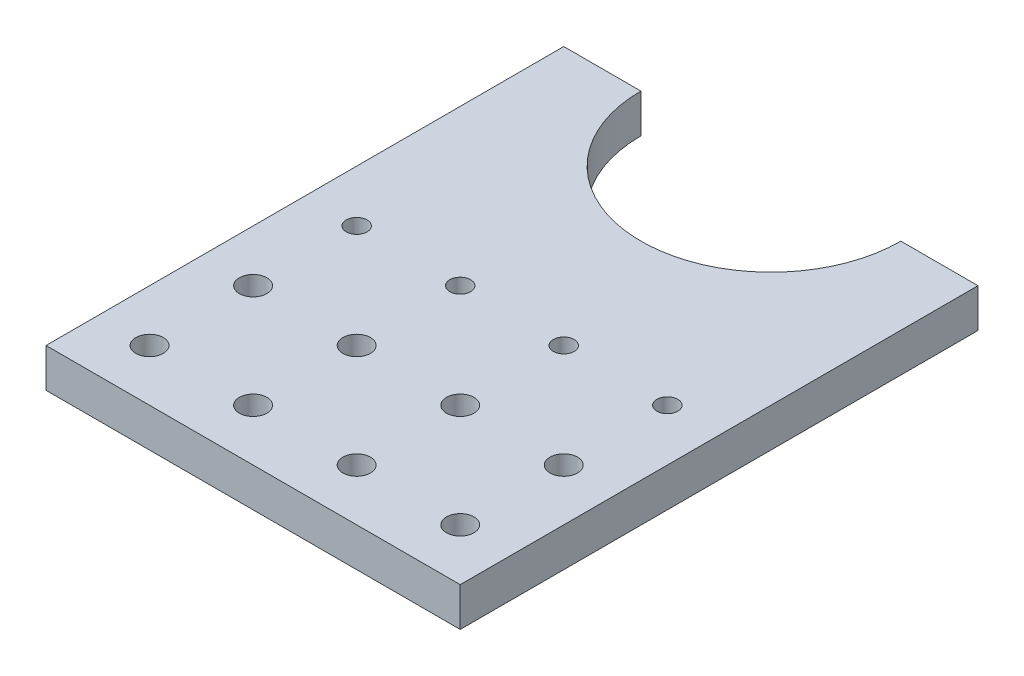
ISO-10303-21;
HEADER;
FILE_DESCRIPTION(('STEP AP214'),'2;1');
FILE_NAME('part.step','',(''),(''),'','','');
FILE_SCHEMA(('AUTOMOTIVE_DESIGN { 1 0 10303 214 1 1 1 1 }'));
ENDSEC;
DATA;
#1=APPLICATION_CONTEXT('core data for automotive mechanical design processes');
#2=APPLICATION_PROTOCOL_DEFINITION('international standard','automotive_design',2000,#1);
#3=PRODUCT_CONTEXT('',#1,'mechanical');
#4=PRODUCT('Part','Part','',(#3));
#5=PRODUCT_RELATED_PRODUCT_CATEGORY('part','',(#4));
#6=PRODUCT_DEFINITION_FORMATION('','',#4);
#7=PRODUCT_DEFINITION_CONTEXT('part definition',#1,'design');
#8=PRODUCT_DEFINITION('design','',#6,#7);
#9=PRODUCT_DEFINITION_SHAPE('','',#8);
#10=(LENGTH_UNIT() NAMED_UNIT(*) SI_UNIT(.MILLI.,.METRE.));
#11=(NAMED_UNIT(*) PLANE_ANGLE_UNIT() SI_UNIT($,.RADIAN.));
#12=(NAMED_UNIT(*) SI_UNIT($,.STERADIAN.) SOLID_ANGLE_UNIT());
#13=UNCERTAINTY_MEASURE_WITH_UNIT(LENGTH_MEASURE(1.E-05),#10,'distance_accuracy_value','');
#14=(GEOMETRIC_REPRESENTATION_CONTEXT(3) GLOBAL_UNCERTAINTY_ASSIGNED_CONTEXT((#13)) GLOBAL_UNIT_ASSIGNED_CONTEXT((#10,
#11,#12)) REPRESENTATION_CONTEXT('',''));
#15=CARTESIAN_POINT('',(0.,0.,0.));
#16=DIRECTION('',(0.,0.,1.));
#17=DIRECTION('',(1.,0.,0.));
#18=AXIS2_PLACEMENT_3D('',#15,#16,#17);
#19=CARTESIAN_POINT('',(0.,9.525,-127.));
#20=DIRECTION('',(0.,-1.,0.));
#21=DIRECTION('',(0.,0.,-1.));
#22=AXIS2_PLACEMENT_3D('',#19,#20,#21);
#23=PLANE('',#22);
#24=CARTESIAN_POINT('',(38.1,9.525,-63.5));
#25=DIRECTION('',(0.,1.,0.));
#26=DIRECTION('',(0.,0.,1.));
#27=AXIS2_PLACEMENT_3D('',#24,#25,#26);
#28=CIRCLE('',#27,2.55269999999999);
#29=CARTESIAN_POINT('',(38.1,9.525,-60.9473));
#30=VERTEX_POINT('',#29);
#31=EDGE_CURVE('E298',#30,#30,#28,.T.);
#32=ORIENTED_EDGE('',*,*,#31,.F.);
#33=EDGE_LOOP('',(#32));
#34=FACE_BOUND('',#33,.T.);
#35=CARTESIAN_POINT('',(88.9,9.525,-38.1));
#36=DIRECTION('',(0.,1.,0.));
#37=DIRECTION('',(0.,0.,1.));
#38=AXIS2_PLACEMENT_3D('',#35,#36,#37);
#39=CIRCLE('',#38,3.37819999999999);
#40=CARTESIAN_POINT('',(88.9,9.525,-34.7218));
#41=VERTEX_POINT('',#40);
#42=EDGE_CURVE('E160',#41,#41,#39,.T.);
#43=ORIENTED_EDGE('',*,*,#42,.F.);
#44=EDGE_LOOP('',(#43));
#45=FACE_BOUND('',#44,.T.);
#46=CARTESIAN_POINT('',(88.9,9.525,-12.7));
#47=DIRECTION('',(0.,1.,0.));
#48=DIRECTION('',(0.,0.,1.));
#49=AXIS2_PLACEMENT_3D('',#46,#47,#48);
#50=CIRCLE('',#49,3.37819999999999);
#51=CARTESIAN_POINT('',(88.9,9.525,-9.32180000000001));
#52=VERTEX_POINT('',#51);
#53=EDGE_CURVE('E154',#52,#52,#50,.T.);
#54=ORIENTED_EDGE('',*,*,#53,.F.);
#55=EDGE_LOOP('',(#54));
#56=FACE_BOUND('',#55,.T.);
#57=CARTESIAN_POINT('',(63.5,9.525,-38.1));
#58=DIRECTION('',(0.,1.,0.));
#59=DIRECTION('',(0.,0.,1.));
#60=AXIS2_PLACEMENT_3D('',#57,#58,#59);
#61=CIRCLE('',#60,3.37819999999999);
#62=CARTESIAN_POINT('',(63.5,9.525,-34.7218));
#63=VERTEX_POINT('',#62);
#64=EDGE_CURVE('E148',#63,#63,#61,.T.);
#65=ORIENTED_EDGE('',*,*,#64,.F.);
#66=EDGE_LOOP('',(#65));
#67=FACE_BOUND('',#66,.T.);
#68=CARTESIAN_POINT('',(63.5,9.525,-12.7));
#69=DIRECTION('',(0.,1.,0.));
#70=DIRECTION('',(0.,0.,1.));
#71=AXIS2_PLACEMENT_3D('',#68,#69,#70);
#72=CIRCLE('',#71,3.37819999999999);
#73=CARTESIAN_POINT('',(63.5,9.525,-9.32180000000001));
#74=VERTEX_POINT('',#73);
#75=EDGE_CURVE('E142',#74,#74,#72,.T.);
#76=ORIENTED_EDGE('',*,*,#75,.F.);
#77=EDGE_LOOP('',(#76));
#78=FACE_BOUND('',#77,.T.);
#79=CARTESIAN_POINT('',(38.1,9.525,-38.1));
#80=DIRECTION('',(0.,1.,0.));
#81=DIRECTION('',(0.,0.,1.));
#82=AXIS2_PLACEMENT_3D('',#79,#80,#81);
#83=CIRCLE('',#82,3.37819999999999);
#84=CARTESIAN_POINT('',(38.1,9.525,-34.7218));
#85=VERTEX_POINT('',#84);
#86=EDGE_CURVE('E136',#85,#85,#83,.T.);
#87=ORIENTED_EDGE('',*,*,#86,.F.);
#88=EDGE_LOOP('',(#87));
#89=FACE_BOUND('',#88,.T.);
#90=CARTESIAN_POINT('',(38.1,9.525,-12.7));
#91=DIRECTION('',(0.,1.,0.));
#92=DIRECTION('',(0.,0.,1.));
#93=AXIS2_PLACEMENT_3D('',#90,#91,#92);
#94=CIRCLE('',#93,3.37819999999999);
#95=CARTESIAN_POINT('',(38.1,9.525,-9.32180000000001));
#96=VERTEX_POINT('',#95);
#97=EDGE_CURVE('E130',#96,#96,#94,.T.);
#98=ORIENTED_EDGE('',*,*,#97,.F.);
#99=EDGE_LOOP('',(#98));
#100=FACE_BOUND('',#99,.T.);
#101=DIRECTION('',(-1.,0.,0.));
#102=VECTOR('',#101,1.);
#103=CARTESIAN_POINT('',(0.,9.525,-127.));
#104=LINE('',#103,#102);
#105=CARTESIAN_POINT('',(101.6,9.525,-127.));
#106=VERTEX_POINT('',#105);
#107=CARTESIAN_POINT('',(82.677,9.525,-127.));
#108=VERTEX_POINT('',#107);
#109=EDGE_CURVE('E121',#106,#108,#104,.T.);
#110=ORIENTED_EDGE('',*,*,#109,.T.);
#111=CARTESIAN_POINT('',(50.8,9.525,-127.));
#112=DIRECTION('',(0.,1.,0.));
#113=DIRECTION('',(0.,0.,1.));
#114=AXIS2_PLACEMENT_3D('',#111,#112,#113);
#115=CIRCLE('',#114,31.877);
#116=CARTESIAN_POINT('',(18.923,9.525,-127.));
#117=VERTEX_POINT('',#116);
#118=EDGE_CURVE('E103',#117,#108,#115,.T.);
#119=ORIENTED_EDGE('',*,*,#118,.F.);
#120=CARTESIAN_POINT('',(0.,9.525,-127.));
#121=VERTEX_POINT('',#120);
#122=EDGE_CURVE('E56',#117,#121,#104,.T.);
#123=ORIENTED_EDGE('',*,*,#122,.T.);
#124=DIRECTION('',(0.,0.,1.));
#125=VECTOR('',#124,1.);
#126=CARTESIAN_POINT('',(0.,9.525,0.));
#127=LINE('',#126,#125);
#128=CARTESIAN_POINT('',(0.,9.525,0.));
#129=VERTEX_POINT('',#128);
#130=EDGE_CURVE('E113',#121,#129,#127,.T.);
#131=ORIENTED_EDGE('',*,*,#130,.T.);
#132=DIRECTION('',(1.,0.,0.));
#133=VECTOR('',#132,1.);
#134=CARTESIAN_POINT('',(0.,9.525,0.));
#135=LINE('',#134,#133);
#136=CARTESIAN_POINT('',(101.6,9.525,0.));
#137=VERTEX_POINT('',#136);
#138=EDGE_CURVE('E86',#129,#137,#135,.T.);
#139=ORIENTED_EDGE('',*,*,#138,.T.);
#140=DIRECTION('',(0.,0.,-1.));
#141=VECTOR('',#140,1.);
#142=CARTESIAN_POINT('',(101.6,9.525,0.));
#143=LINE('',#142,#141);
#144=EDGE_CURVE('E280',#137,#106,#143,.T.);
#145=ORIENTED_EDGE('',*,*,#144,.T.);
#146=EDGE_LOOP('',(#110,#119,#123,#131,#139,#145));
#147=FACE_BOUND('',#146,.T.);
#148=CARTESIAN_POINT('',(12.7,9.525,-12.7));
#149=DIRECTION('',(0.,1.,0.));
#150=DIRECTION('',(0.,0.,1.));
#151=AXIS2_PLACEMENT_3D('',#148,#149,#150);
#152=CIRCLE('',#151,3.37819999999999);
#153=CARTESIAN_POINT('',(12.7,9.525,-9.32180000000001));
#154=VERTEX_POINT('',#153);
#155=EDGE_CURVE('E266',#154,#154,#152,.T.);
#156=ORIENTED_EDGE('',*,*,#155,.F.);
#157=EDGE_LOOP('',(#156));
#158=FACE_BOUND('',#157,.T.);
#159=CARTESIAN_POINT('',(12.7,9.525,-38.1));
#160=DIRECTION('',(0.,1.,0.));
#161=DIRECTION('',(0.,0.,1.));
#162=AXIS2_PLACEMENT_3D('',#159,#160,#161);
#163=CIRCLE('',#162,3.37819999999999);
#164=CARTESIAN_POINT('',(12.7,9.525,-34.7218));
#165=VERTEX_POINT('',#164);
#166=EDGE_CURVE('E268',#165,#165,#163,.T.);
#167=ORIENTED_EDGE('',*,*,#166,.F.);
#168=EDGE_LOOP('',(#167));
#169=FACE_BOUND('',#168,.T.);
#170=CARTESIAN_POINT('',(12.7,9.525,-63.5));
#171=DIRECTION('',(0.,1.,0.));
#172=DIRECTION('',(0.,0.,1.));
#173=AXIS2_PLACEMENT_3D('',#170,#171,#172);
#174=CIRCLE('',#173,2.55269999999999);
#175=CARTESIAN_POINT('',(12.7,9.525,-60.9473));
#176=VERTEX_POINT('',#175);
#177=EDGE_CURVE('E295',#176,#176,#174,.T.);
#178=ORIENTED_EDGE('',*,*,#177,.F.);
#179=EDGE_LOOP('',(#178));
#180=FACE_BOUND('',#179,.T.);
#181=CARTESIAN_POINT('',(63.5,9.525,-63.5));
#182=DIRECTION('',(0.,1.,0.));
#183=DIRECTION('',(0.,0.,1.));
#184=AXIS2_PLACEMENT_3D('',#181,#182,#183);
#185=CIRCLE('',#184,2.55269999999999);
#186=CARTESIAN_POINT('',(63.5,9.525,-60.9473));
#187=VERTEX_POINT('',#186);
#188=EDGE_CURVE('E166',#187,#187,#185,.T.);
#189=ORIENTED_EDGE('',*,*,#188,.F.);
#190=EDGE_LOOP('',(#189));
#191=FACE_BOUND('',#190,.T.);
#192=CARTESIAN_POINT('',(88.9,9.525,-63.5));
#193=DIRECTION('',(0.,1.,0.));
#194=DIRECTION('',(0.,0.,1.));
#195=AXIS2_PLACEMENT_3D('',#192,#193,#194);
#196=CIRCLE('',#195,2.55269999999999);
#197=CARTESIAN_POINT('',(88.9,9.525,-60.9473));
#198=VERTEX_POINT('',#197);
#199=EDGE_CURVE('E11',#198,#198,#196,.T.);
#200=ORIENTED_EDGE('',*,*,#199,.F.);
#201=EDGE_LOOP('',(#200));
#202=FACE_BOUND('',#201,.T.);
#203=ADVANCED_FACE('F32',(#34,#45,#56,#67,#78,#89,#100,#147,#158,#169,#180,#191,#202),#23,.F.);
#204=CARTESIAN_POINT('',(0.,9.525,-127.));
#205=DIRECTION('',(0.,0.,1.));
#206=DIRECTION('',(1.,0.,0.));
#207=AXIS2_PLACEMENT_3D('',#204,#205,#206);
#208=PLANE('',#207);
#209=DIRECTION('',(-1.,0.,0.));
#210=VECTOR('',#209,1.);
#211=CARTESIAN_POINT('',(0.,0.,-127.));
#212=LINE('',#211,#210);
#213=CARTESIAN_POINT('',(101.6,0.,-127.));
#214=VERTEX_POINT('',#213);
#215=CARTESIAN_POINT('',(82.677,0.,-127.));
#216=VERTEX_POINT('',#215);
#217=EDGE_CURVE('E110',#214,#216,#212,.T.);
#218=ORIENTED_EDGE('',*,*,#217,.T.);
#219=DIRECTION('',(0.,1.,0.));
#220=VECTOR('',#219,1.);
#221=CARTESIAN_POINT('',(82.677,0.,-127.));
#222=LINE('',#221,#220);
#223=EDGE_CURVE('E47',#216,#108,#222,.T.);
#224=ORIENTED_EDGE('',*,*,#223,.T.);
#225=ORIENTED_EDGE('',*,*,#109,.F.);
#226=DIRECTION('',(0.,-1.,0.));
#227=VECTOR('',#226,1.);
#228=CARTESIAN_POINT('',(101.6,9.525,-127.));
#229=LINE('',#228,#227);
#230=EDGE_CURVE('E120',#106,#214,#229,.T.);
#231=ORIENTED_EDGE('',*,*,#230,.T.);
#232=EDGE_LOOP('',(#218,#224,#225,#231));
#233=FACE_BOUND('',#232,.T.);
#234=ADVANCED_FACE('F178',(#233),#208,.F.);
#235=CARTESIAN_POINT('',(0.,9.525,0.));
#236=DIRECTION('',(1.,0.,0.));
#237=DIRECTION('',(0.,0.,-1.));
#238=AXIS2_PLACEMENT_3D('',#235,#236,#237);
#239=PLANE('',#238);
#240=DIRECTION('',(0.,0.,1.));
#241=VECTOR('',#240,1.);
#242=CARTESIAN_POINT('',(0.,0.,0.));
#243=LINE('',#242,#241);
#244=CARTESIAN_POINT('',(0.,0.,-127.));
#245=VERTEX_POINT('',#244);
#246=CARTESIAN_POINT('',(0.,0.,0.));
#247=VERTEX_POINT('',#246);
#248=EDGE_CURVE('E109',#245,#247,#243,.T.);
#249=ORIENTED_EDGE('',*,*,#248,.T.);
#250=DIRECTION('',(0.,-1.,0.));
#251=VECTOR('',#250,1.);
#252=CARTESIAN_POINT('',(0.,9.525,0.));
#253=LINE('',#252,#251);
#254=EDGE_CURVE('E100',#129,#247,#253,.T.);
#255=ORIENTED_EDGE('',*,*,#254,.F.);
#256=ORIENTED_EDGE('',*,*,#130,.F.);
#257=DIRECTION('',(0.,-1.,0.));
#258=VECTOR('',#257,1.);
#259=CARTESIAN_POINT('',(0.,9.525,-127.));
#260=LINE('',#259,#258);
#261=EDGE_CURVE('E118',#121,#245,#260,.T.);
#262=ORIENTED_EDGE('',*,*,#261,.T.);
#263=EDGE_LOOP('',(#249,#255,#256,#262));
#264=FACE_BOUND('',#263,.T.);
#265=ADVANCED_FACE('F184',(#264),#239,.F.);
#266=CARTESIAN_POINT('',(0.,9.525,0.));
#267=DIRECTION('',(0.,0.,-1.));
#268=DIRECTION('',(-1.,0.,0.));
#269=AXIS2_PLACEMENT_3D('',#266,#267,#268);
#270=PLANE('',#269);
#271=DIRECTION('',(1.,0.,0.));
#272=VECTOR('',#271,1.);
#273=CARTESIAN_POINT('',(0.,0.,0.));
#274=LINE('',#273,#272);
#275=CARTESIAN_POINT('',(101.6,0.,0.));
#276=VERTEX_POINT('',#275);
#277=EDGE_CURVE('E114',#247,#276,#274,.T.);
#278=ORIENTED_EDGE('',*,*,#277,.T.);
#279=DIRECTION('',(0.,-1.,0.));
#280=VECTOR('',#279,1.);
#281=CARTESIAN_POINT('',(101.6,9.525,0.));
#282=LINE('',#281,#280);
#283=EDGE_CURVE('E124',#137,#276,#282,.T.);
#284=ORIENTED_EDGE('',*,*,#283,.F.);
#285=ORIENTED_EDGE('',*,*,#138,.F.);
#286=ORIENTED_EDGE('',*,*,#254,.T.);
#287=EDGE_LOOP('',(#278,#284,#285,#286));
#288=FACE_BOUND('',#287,.T.);
#289=ADVANCED_FACE('F199',(#288),#270,.F.);
#290=CARTESIAN_POINT('',(101.6,9.525,0.));
#291=DIRECTION('',(-1.,0.,0.));
#292=DIRECTION('',(0.,0.,1.));
#293=AXIS2_PLACEMENT_3D('',#290,#291,#292);
#294=PLANE('',#293);
#295=DIRECTION('',(0.,0.,-1.));
#296=VECTOR('',#295,1.);
#297=CARTESIAN_POINT('',(101.6,0.,0.));
#298=LINE('',#297,#296);
#299=EDGE_CURVE('E111',#276,#214,#298,.T.);
#300=ORIENTED_EDGE('',*,*,#299,.T.);
#301=ORIENTED_EDGE('',*,*,#230,.F.);
#302=ORIENTED_EDGE('',*,*,#144,.F.);
#303=ORIENTED_EDGE('',*,*,#283,.T.);
#304=EDGE_LOOP('',(#300,#301,#302,#303));
#305=FACE_BOUND('',#304,.T.);
#306=ADVANCED_FACE('F196',(#305),#294,.F.);
#307=ORIENTED_EDGE('',*,*,#122,.F.);
#308=DIRECTION('',(0.,1.,0.));
#309=VECTOR('',#308,1.);
#310=CARTESIAN_POINT('',(18.923,0.,-127.));
#311=LINE('',#310,#309);
#312=CARTESIAN_POINT('',(18.923,0.,-127.));
#313=VERTEX_POINT('',#312);
#314=EDGE_CURVE('E95',#117,#313,#311,.F.);
#315=ORIENTED_EDGE('',*,*,#314,.T.);
#316=EDGE_CURVE('E78',#313,#245,#212,.T.);
#317=ORIENTED_EDGE('',*,*,#316,.T.);
#318=ORIENTED_EDGE('',*,*,#261,.F.);
#319=EDGE_LOOP('',(#307,#315,#317,#318));
#320=FACE_BOUND('',#319,.T.);
#321=ADVANCED_FACE('F102',(#320),#208,.F.);
#322=CARTESIAN_POINT('',(0.,0.,-127.));
#323=DIRECTION('',(0.,-1.,0.));
#324=DIRECTION('',(0.,0.,-1.));
#325=AXIS2_PLACEMENT_3D('',#322,#323,#324);
#326=PLANE('',#325);
#327=CARTESIAN_POINT('',(38.1,0.,-63.5));
#328=DIRECTION('',(0.,1.,0.));
#329=DIRECTION('',(0.,0.,1.));
#330=AXIS2_PLACEMENT_3D('',#327,#328,#329);
#331=CIRCLE('',#330,2.5527);
#332=CARTESIAN_POINT('',(38.1,0.,-60.9473));
#333=VERTEX_POINT('',#332);
#334=EDGE_CURVE('E303',#333,#333,#331,.T.);
#335=ORIENTED_EDGE('',*,*,#334,.T.);
#336=EDGE_LOOP('',(#335));
#337=FACE_BOUND('',#336,.T.);
#338=CARTESIAN_POINT('',(12.7,0.,-63.5));
#339=DIRECTION('',(0.,1.,0.));
#340=DIRECTION('',(0.,0.,1.));
#341=AXIS2_PLACEMENT_3D('',#338,#339,#340);
#342=CIRCLE('',#341,2.5527);
#343=CARTESIAN_POINT('',(12.7,0.,-60.9473));
#344=VERTEX_POINT('',#343);
#345=EDGE_CURVE('E297',#344,#344,#342,.T.);
#346=ORIENTED_EDGE('',*,*,#345,.T.);
#347=EDGE_LOOP('',(#346));
#348=FACE_BOUND('',#347,.T.);
#349=CARTESIAN_POINT('',(12.7,0.,-38.1));
#350=DIRECTION('',(0.,1.,0.));
#351=DIRECTION('',(0.,0.,1.));
#352=AXIS2_PLACEMENT_3D('',#349,#350,#351);
#353=CIRCLE('',#352,3.3782);
#354=CARTESIAN_POINT('',(12.7,0.,-34.7218));
#355=VERTEX_POINT('',#354);
#356=EDGE_CURVE('E272',#355,#355,#353,.T.);
#357=ORIENTED_EDGE('',*,*,#356,.T.);
#358=EDGE_LOOP('',(#357));
#359=FACE_BOUND('',#358,.T.);
#360=CARTESIAN_POINT('',(12.7,0.,-12.7));
#361=DIRECTION('',(0.,1.,0.));
#362=DIRECTION('',(0.,0.,1.));
#363=AXIS2_PLACEMENT_3D('',#360,#361,#362);
#364=CIRCLE('',#363,3.3782);
#365=CARTESIAN_POINT('',(12.7,0.,-9.3218));
#366=VERTEX_POINT('',#365);
#367=EDGE_CURVE('E263',#366,#366,#364,.T.);
#368=ORIENTED_EDGE('',*,*,#367,.T.);
#369=EDGE_LOOP('',(#368));
#370=FACE_BOUND('',#369,.T.);
#371=CARTESIAN_POINT('',(50.8,0.,-127.));
#372=DIRECTION('',(0.,-1.,0.));
#373=DIRECTION('',(0.,0.,-1.));
#374=AXIS2_PLACEMENT_3D('',#371,#372,#373);
#375=CIRCLE('',#374,31.877);
#376=EDGE_CURVE('E93',#216,#313,#375,.T.);
#377=ORIENTED_EDGE('',*,*,#376,.F.);
#378=ORIENTED_EDGE('',*,*,#217,.F.);
#379=ORIENTED_EDGE('',*,*,#299,.F.);
#380=ORIENTED_EDGE('',*,*,#277,.F.);
#381=ORIENTED_EDGE('',*,*,#248,.F.);
#382=ORIENTED_EDGE('',*,*,#316,.F.);
#383=EDGE_LOOP('',(#377,#378,#379,#380,#381,#382));
#384=FACE_BOUND('',#383,.T.);
#385=CARTESIAN_POINT('',(38.1,0.,-12.7));
#386=DIRECTION('',(0.,1.,0.));
#387=DIRECTION('',(0.,0.,1.));
#388=AXIS2_PLACEMENT_3D('',#385,#386,#387);
#389=CIRCLE('',#388,3.3782);
#390=CARTESIAN_POINT('',(38.1,0.,-9.3218));
#391=VERTEX_POINT('',#390);
#392=EDGE_CURVE('E99',#391,#391,#389,.T.);
#393=ORIENTED_EDGE('',*,*,#392,.T.);
#394=EDGE_LOOP('',(#393));
#395=FACE_BOUND('',#394,.T.);
#396=CARTESIAN_POINT('',(38.1,0.,-38.1));
#397=DIRECTION('',(0.,1.,0.));
#398=DIRECTION('',(0.,0.,1.));
#399=AXIS2_PLACEMENT_3D('',#396,#397,#398);
#400=CIRCLE('',#399,3.3782);
#401=CARTESIAN_POINT('',(38.1,0.,-34.7218));
#402=VERTEX_POINT('',#401);
#403=EDGE_CURVE('E133',#402,#402,#400,.T.);
#404=ORIENTED_EDGE('',*,*,#403,.T.);
#405=EDGE_LOOP('',(#404));
#406=FACE_BOUND('',#405,.T.);
#407=CARTESIAN_POINT('',(63.5,0.,-12.7));
#408=DIRECTION('',(0.,1.,0.));
#409=DIRECTION('',(0.,0.,1.));
#410=AXIS2_PLACEMENT_3D('',#407,#408,#409);
#411=CIRCLE('',#410,3.3782);
#412=CARTESIAN_POINT('',(63.5,0.,-9.3218));
#413=VERTEX_POINT('',#412);
#414=EDGE_CURVE('E139',#413,#413,#411,.T.);
#415=ORIENTED_EDGE('',*,*,#414,.T.);
#416=EDGE_LOOP('',(#415));
#417=FACE_BOUND('',#416,.T.);
#418=CARTESIAN_POINT('',(63.5,0.,-38.1));
#419=DIRECTION('',(0.,1.,0.));
#420=DIRECTION('',(0.,0.,1.));
#421=AXIS2_PLACEMENT_3D('',#418,#419,#420);
#422=CIRCLE('',#421,3.3782);
#423=CARTESIAN_POINT('',(63.5,0.,-34.7218));
#424=VERTEX_POINT('',#423);
#425=EDGE_CURVE('E145',#424,#424,#422,.T.);
#426=ORIENTED_EDGE('',*,*,#425,.T.);
#427=EDGE_LOOP('',(#426));
#428=FACE_BOUND('',#427,.T.);
#429=CARTESIAN_POINT('',(88.9,0.,-12.7));
#430=DIRECTION('',(0.,1.,0.));
#431=DIRECTION('',(0.,0.,1.));
#432=AXIS2_PLACEMENT_3D('',#429,#430,#431);
#433=CIRCLE('',#432,3.3782);
#434=CARTESIAN_POINT('',(88.9,0.,-9.3218));
#435=VERTEX_POINT('',#434);
#436=EDGE_CURVE('E151',#435,#435,#433,.T.);
#437=ORIENTED_EDGE('',*,*,#436,.T.);
#438=EDGE_LOOP('',(#437));
#439=FACE_BOUND('',#438,.T.);
#440=CARTESIAN_POINT('',(88.9,0.,-38.1));
#441=DIRECTION('',(0.,1.,0.));
#442=DIRECTION('',(0.,0.,1.));
#443=AXIS2_PLACEMENT_3D('',#440,#441,#442);
#444=CIRCLE('',#443,3.3782);
#445=CARTESIAN_POINT('',(88.9,0.,-34.7218));
#446=VERTEX_POINT('',#445);
#447=EDGE_CURVE('E157',#446,#446,#444,.T.);
#448=ORIENTED_EDGE('',*,*,#447,.T.);
#449=EDGE_LOOP('',(#448));
#450=FACE_BOUND('',#449,.T.);
#451=CARTESIAN_POINT('',(63.5,0.,-63.5));
#452=DIRECTION('',(0.,1.,0.));
#453=DIRECTION('',(0.,0.,1.));
#454=AXIS2_PLACEMENT_3D('',#451,#452,#453);
#455=CIRCLE('',#454,2.5527);
#456=CARTESIAN_POINT('',(63.5,0.,-60.9473));
#457=VERTEX_POINT('',#456);
#458=EDGE_CURVE('E163',#457,#457,#455,.T.);
#459=ORIENTED_EDGE('',*,*,#458,.T.);
#460=EDGE_LOOP('',(#459));
#461=FACE_BOUND('',#460,.T.);
#462=CARTESIAN_POINT('',(88.9,0.,-63.5));
#463=DIRECTION('',(0.,1.,0.));
#464=DIRECTION('',(0.,0.,1.));
#465=AXIS2_PLACEMENT_3D('',#462,#463,#464);
#466=CIRCLE('',#465,2.5527);
#467=CARTESIAN_POINT('',(88.9,0.,-60.9473));
#468=VERTEX_POINT('',#467);
#469=EDGE_CURVE('E40',#468,#468,#466,.T.);
#470=ORIENTED_EDGE('',*,*,#469,.T.);
#471=EDGE_LOOP('',(#470));
#472=FACE_BOUND('',#471,.T.);
#473=ADVANCED_FACE('F106',(#337,#348,#359,#370,#384,#395,#406,#417,#428,#439,#450,#461,#472),
#326,.T.);
#474=CARTESIAN_POINT('',(50.8,0.,-127.));
#475=DIRECTION('',(0.,1.,0.));
#476=DIRECTION('',(0.,0.,1.));
#477=AXIS2_PLACEMENT_3D('',#474,#475,#476);
#478=CYLINDRICAL_SURFACE('',#477,31.877);
#479=ORIENTED_EDGE('',*,*,#376,.T.);
#480=ORIENTED_EDGE('',*,*,#314,.F.);
#481=ORIENTED_EDGE('',*,*,#118,.T.);
#482=ORIENTED_EDGE('',*,*,#223,.F.);
#483=EDGE_LOOP('',(#479,#480,#481,#482));
#484=FACE_BOUND('',#483,.T.);
#485=ADVANCED_FACE('F94',(#484),#478,.F.);
#486=CARTESIAN_POINT('',(12.7,9.525,-12.7));
#487=DIRECTION('',(0.,1.,0.));
#488=DIRECTION('',(0.,0.,1.));
#489=AXIS2_PLACEMENT_3D('',#486,#487,#488);
#490=CYLINDRICAL_SURFACE('',#489,3.37819999999999);
#491=ORIENTED_EDGE('',*,*,#367,.F.);
#492=EDGE_LOOP('',(#491));
#493=FACE_BOUND('',#492,.T.);
#494=ORIENTED_EDGE('',*,*,#155,.T.);
#495=EDGE_LOOP('',(#494));
#496=FACE_BOUND('',#495,.T.);
#497=ADVANCED_FACE('F253',(#493,#496),#490,.F.);
#498=CARTESIAN_POINT('',(12.7,9.525,-38.1));
#499=DIRECTION('',(0.,1.,0.));
#500=DIRECTION('',(0.,0.,1.));
#501=AXIS2_PLACEMENT_3D('',#498,#499,#500);
#502=CYLINDRICAL_SURFACE('',#501,3.37819999999999);
#503=ORIENTED_EDGE('',*,*,#356,.F.);
#504=EDGE_LOOP('',(#503));
#505=FACE_BOUND('',#504,.T.);
#506=ORIENTED_EDGE('',*,*,#166,.T.);
#507=EDGE_LOOP('',(#506));
#508=FACE_BOUND('',#507,.T.);
#509=ADVANCED_FACE('F210',(#505,#508),#502,.F.);
#510=CARTESIAN_POINT('',(38.1,9.525,-12.7));
#511=DIRECTION('',(0.,1.,0.));
#512=DIRECTION('',(0.,0.,1.));
#513=AXIS2_PLACEMENT_3D('',#510,#511,#512);
#514=CYLINDRICAL_SURFACE('',#513,3.37819999999999);
#515=ORIENTED_EDGE('',*,*,#392,.F.);
#516=EDGE_LOOP('',(#515));
#517=FACE_BOUND('',#516,.T.);
#518=ORIENTED_EDGE('',*,*,#97,.T.);
#519=EDGE_LOOP('',(#518));
#520=FACE_BOUND('',#519,.T.);
#521=ADVANCED_FACE('F206',(#517,#520),#514,.F.);
#522=CARTESIAN_POINT('',(38.1,9.525,-38.1));
#523=DIRECTION('',(0.,1.,0.));
#524=DIRECTION('',(0.,0.,1.));
#525=AXIS2_PLACEMENT_3D('',#522,#523,#524);
#526=CYLINDRICAL_SURFACE('',#525,3.37819999999999);
#527=ORIENTED_EDGE('',*,*,#403,.F.);
#528=EDGE_LOOP('',(#527));
#529=FACE_BOUND('',#528,.T.);
#530=ORIENTED_EDGE('',*,*,#86,.T.);
#531=EDGE_LOOP('',(#530));
#532=FACE_BOUND('',#531,.T.);
#533=ADVANCED_FACE('F209',(#529,#532),#526,.F.);
#534=CARTESIAN_POINT('',(63.5,9.525,-12.7));
#535=DIRECTION('',(0.,1.,0.));
#536=DIRECTION('',(0.,0.,1.));
#537=AXIS2_PLACEMENT_3D('',#534,#535,#536);
#538=CYLINDRICAL_SURFACE('',#537,3.37819999999999);
#539=ORIENTED_EDGE('',*,*,#414,.F.);
#540=EDGE_LOOP('',(#539));
#541=FACE_BOUND('',#540,.T.);
#542=ORIENTED_EDGE('',*,*,#75,.T.);
#543=EDGE_LOOP('',(#542));
#544=FACE_BOUND('',#543,.T.);
#545=ADVANCED_FACE('F214',(#541,#544),#538,.F.);
#546=CARTESIAN_POINT('',(63.5,9.525,-38.1));
#547=DIRECTION('',(0.,1.,0.));
#548=DIRECTION('',(0.,0.,1.));
#549=AXIS2_PLACEMENT_3D('',#546,#547,#548);
#550=CYLINDRICAL_SURFACE('',#549,3.37819999999999);
#551=ORIENTED_EDGE('',*,*,#425,.F.);
#552=EDGE_LOOP('',(#551));
#553=FACE_BOUND('',#552,.T.);
#554=ORIENTED_EDGE('',*,*,#64,.T.);
#555=EDGE_LOOP('',(#554));
#556=FACE_BOUND('',#555,.T.);
#557=ADVANCED_FACE('F218',(#553,#556),#550,.F.);
#558=CARTESIAN_POINT('',(88.9,9.525,-12.7));
#559=DIRECTION('',(0.,1.,0.));
#560=DIRECTION('',(0.,0.,1.));
#561=AXIS2_PLACEMENT_3D('',#558,#559,#560);
#562=CYLINDRICAL_SURFACE('',#561,3.37819999999999);
#563=ORIENTED_EDGE('',*,*,#436,.F.);
#564=EDGE_LOOP('',(#563));
#565=FACE_BOUND('',#564,.T.);
#566=ORIENTED_EDGE('',*,*,#53,.T.);
#567=EDGE_LOOP('',(#566));
#568=FACE_BOUND('',#567,.T.);
#569=ADVANCED_FACE('F222',(#565,#568),#562,.F.);
#570=CARTESIAN_POINT('',(88.9,9.525,-38.1));
#571=DIRECTION('',(0.,1.,0.));
#572=DIRECTION('',(0.,0.,1.));
#573=AXIS2_PLACEMENT_3D('',#570,#571,#572);
#574=CYLINDRICAL_SURFACE('',#573,3.37819999999999);
#575=ORIENTED_EDGE('',*,*,#447,.F.);
#576=EDGE_LOOP('',(#575));
#577=FACE_BOUND('',#576,.T.);
#578=ORIENTED_EDGE('',*,*,#42,.T.);
#579=EDGE_LOOP('',(#578));
#580=FACE_BOUND('',#579,.T.);
#581=ADVANCED_FACE('F226',(#577,#580),#574,.F.);
#582=CARTESIAN_POINT('',(12.7,9.525,-63.5));
#583=DIRECTION('',(0.,1.,0.));
#584=DIRECTION('',(0.,0.,1.));
#585=AXIS2_PLACEMENT_3D('',#582,#583,#584);
#586=CYLINDRICAL_SURFACE('',#585,2.55269999999999);
#587=ORIENTED_EDGE('',*,*,#345,.F.);
#588=EDGE_LOOP('',(#587));
#589=FACE_BOUND('',#588,.T.);
#590=ORIENTED_EDGE('',*,*,#177,.T.);
#591=EDGE_LOOP('',(#590));
#592=FACE_BOUND('',#591,.T.);
#593=ADVANCED_FACE('F229',(#589,#592),#586,.F.);
#594=CARTESIAN_POINT('',(38.1,9.525,-63.5));
#595=DIRECTION('',(0.,1.,0.));
#596=DIRECTION('',(0.,0.,1.));
#597=AXIS2_PLACEMENT_3D('',#594,#595,#596);
#598=CYLINDRICAL_SURFACE('',#597,2.55269999999999);
#599=ORIENTED_EDGE('',*,*,#334,.F.);
#600=EDGE_LOOP('',(#599));
#601=FACE_BOUND('',#600,.T.);
#602=ORIENTED_EDGE('',*,*,#31,.T.);
#603=EDGE_LOOP('',(#602));
#604=FACE_BOUND('',#603,.T.);
#605=ADVANCED_FACE('F232',(#601,#604),#598,.F.);
#606=CARTESIAN_POINT('',(63.5,9.525,-63.5));
#607=DIRECTION('',(0.,1.,0.));
#608=DIRECTION('',(0.,0.,1.));
#609=AXIS2_PLACEMENT_3D('',#606,#607,#608);
#610=CYLINDRICAL_SURFACE('',#609,2.55269999999999);
#611=ORIENTED_EDGE('',*,*,#458,.F.);
#612=EDGE_LOOP('',(#611));
#613=FACE_BOUND('',#612,.T.);
#614=ORIENTED_EDGE('',*,*,#188,.T.);
#615=EDGE_LOOP('',(#614));
#616=FACE_BOUND('',#615,.T.);
#617=ADVANCED_FACE('F174',(#613,#616),#610,.F.);
#618=CARTESIAN_POINT('',(88.9,9.525,-63.5));
#619=DIRECTION('',(0.,1.,0.));
#620=DIRECTION('',(0.,0.,1.));
#621=AXIS2_PLACEMENT_3D('',#618,#619,#620);
#622=CYLINDRICAL_SURFACE('',#621,2.55269999999999);
#623=ORIENTED_EDGE('',*,*,#469,.F.);
#624=EDGE_LOOP('',(#623));
#625=FACE_BOUND('',#624,.T.);
#626=ORIENTED_EDGE('',*,*,#199,.T.);
#627=EDGE_LOOP('',(#626));
#628=FACE_BOUND('',#627,.T.);
#629=ADVANCED_FACE('F34',(#625,#628),#622,.F.);
#630=CLOSED_SHELL('',(#203,#234,#265,#289,#306,#321,#473,#485,#497,#509,#521,#533,#545,#557,
#569,#581,#593,#605,#617,#629));
#631=MANIFOLD_SOLID_BREP('B2',#630);
#632=ADVANCED_BREP_SHAPE_REPRESENTATION('',(#18,#631),#14);
#633=SHAPE_DEFINITION_REPRESENTATION(#9,#632);
ENDSEC;
END-ISO-10303-21;
